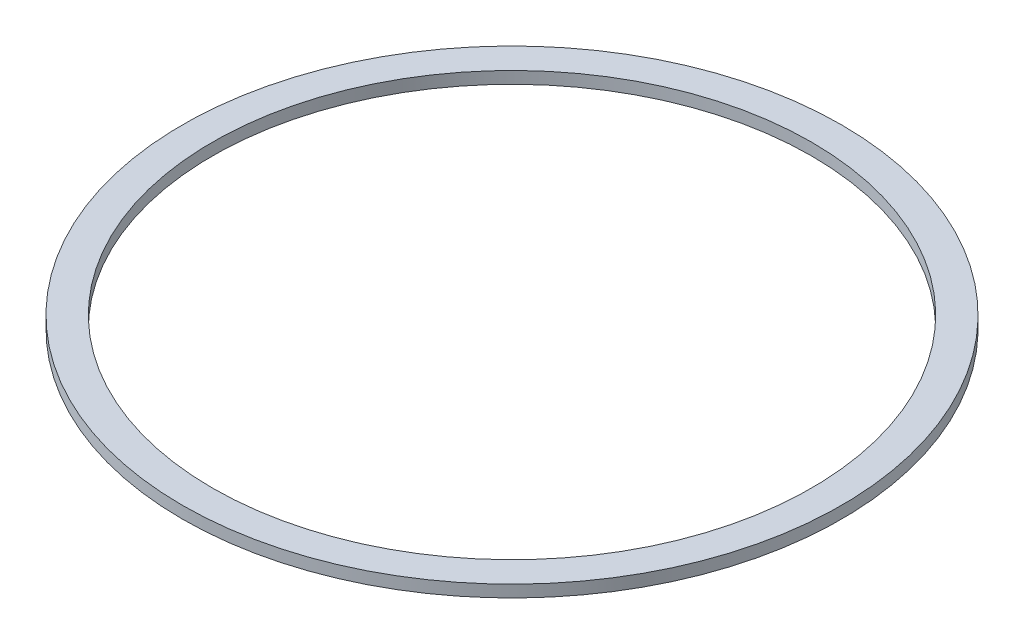
ISO-10303-21;
HEADER;
FILE_DESCRIPTION(('STEP AP214'),'2;1');
FILE_NAME('part.step','',(''),(''),'','','');
FILE_SCHEMA(('AUTOMOTIVE_DESIGN { 1 0 10303 214 1 1 1 1 }'));
ENDSEC;
DATA;
#1=APPLICATION_CONTEXT('core data for automotive mechanical design processes');
#2=APPLICATION_PROTOCOL_DEFINITION('international standard','automotive_design',2000,#1);
#3=PRODUCT_CONTEXT('',#1,'mechanical');
#4=PRODUCT('Part','Part','',(#3));
#5=PRODUCT_RELATED_PRODUCT_CATEGORY('part','',(#4));
#6=PRODUCT_DEFINITION_FORMATION('','',#4);
#7=PRODUCT_DEFINITION_CONTEXT('part definition',#1,'design');
#8=PRODUCT_DEFINITION('design','',#6,#7);
#9=PRODUCT_DEFINITION_SHAPE('','',#8);
#10=(LENGTH_UNIT() NAMED_UNIT(*) SI_UNIT(.MILLI.,.METRE.));
#11=(NAMED_UNIT(*) PLANE_ANGLE_UNIT() SI_UNIT($,.RADIAN.));
#12=(NAMED_UNIT(*) SI_UNIT($,.STERADIAN.) SOLID_ANGLE_UNIT());
#13=UNCERTAINTY_MEASURE_WITH_UNIT(LENGTH_MEASURE(1.E-05),#10,'distance_accuracy_value','');
#14=(GEOMETRIC_REPRESENTATION_CONTEXT(3) GLOBAL_UNCERTAINTY_ASSIGNED_CONTEXT((#13)) GLOBAL_UNIT_ASSIGNED_CONTEXT((#10,
#11,#12)) REPRESENTATION_CONTEXT('',''));
#15=CARTESIAN_POINT('',(0.,0.,0.));
#16=DIRECTION('',(0.,0.,1.));
#17=DIRECTION('',(1.,0.,0.));
#18=AXIS2_PLACEMENT_3D('',#15,#16,#17);
#19=CARTESIAN_POINT('',(0.,3.,0.));
#20=DIRECTION('',(0.,1.,0.));
#21=DIRECTION('',(0.,0.,1.));
#22=AXIS2_PLACEMENT_3D('',#19,#20,#21);
#23=PLANE('',#22);
#24=CARTESIAN_POINT('',(0.,3.,0.));
#25=DIRECTION('',(0.,1.,0.));
#26=DIRECTION('',(0.,0.,1.));
#27=AXIS2_PLACEMENT_3D('',#24,#25,#26);
#28=CIRCLE('',#27,82.5);
#29=CARTESIAN_POINT('',(0.,3.,82.5));
#30=VERTEX_POINT('',#29);
#31=EDGE_CURVE('E10',#30,#30,#28,.T.);
#32=ORIENTED_EDGE('',*,*,#31,.T.);
#33=EDGE_LOOP('',(#32));
#34=FACE_BOUND('',#33,.T.);
#35=CARTESIAN_POINT('',(0.,3.,0.));
#36=DIRECTION('',(0.,1.,0.));
#37=DIRECTION('',(0.,0.,1.));
#38=AXIS2_PLACEMENT_3D('',#35,#36,#37);
#39=CIRCLE('',#38,75.);
#40=CARTESIAN_POINT('',(0.,3.,75.));
#41=VERTEX_POINT('',#40);
#42=EDGE_CURVE('E42',#41,#41,#39,.T.);
#43=ORIENTED_EDGE('',*,*,#42,.F.);
#44=EDGE_LOOP('',(#43));
#45=FACE_BOUND('',#44,.T.);
#46=ADVANCED_FACE('F31',(#34,#45),#23,.T.);
#47=CARTESIAN_POINT('',(0.,0.,0.));
#48=DIRECTION('',(0.,1.,0.));
#49=DIRECTION('',(0.,0.,1.));
#50=AXIS2_PLACEMENT_3D('',#47,#48,#49);
#51=PLANE('',#50);
#52=CARTESIAN_POINT('',(0.,0.,0.));
#53=DIRECTION('',(0.,1.,0.));
#54=DIRECTION('',(0.,0.,1.));
#55=AXIS2_PLACEMENT_3D('',#52,#53,#54);
#56=CIRCLE('',#55,82.5);
#57=CARTESIAN_POINT('',(0.,0.,82.5));
#58=VERTEX_POINT('',#57);
#59=EDGE_CURVE('E35',#58,#58,#56,.T.);
#60=ORIENTED_EDGE('',*,*,#59,.F.);
#61=EDGE_LOOP('',(#60));
#62=FACE_BOUND('',#61,.T.);
#63=CARTESIAN_POINT('',(0.,0.,0.));
#64=DIRECTION('',(0.,1.,0.));
#65=DIRECTION('',(0.,0.,1.));
#66=AXIS2_PLACEMENT_3D('',#63,#64,#65);
#67=CIRCLE('',#66,75.);
#68=CARTESIAN_POINT('',(0.,0.,75.));
#69=VERTEX_POINT('',#68);
#70=EDGE_CURVE('E44',#69,#69,#67,.T.);
#71=ORIENTED_EDGE('',*,*,#70,.T.);
#72=EDGE_LOOP('',(#71));
#73=FACE_BOUND('',#72,.T.);
#74=ADVANCED_FACE('F54',(#62,#73),#51,.F.);
#75=CARTESIAN_POINT('',(0.,3.,0.));
#76=DIRECTION('',(0.,-1.,0.));
#77=DIRECTION('',(0.,0.,-1.));
#78=AXIS2_PLACEMENT_3D('',#75,#76,#77);
#79=CYLINDRICAL_SURFACE('',#78,82.5);
#80=ORIENTED_EDGE('',*,*,#31,.F.);
#81=EDGE_LOOP('',(#80));
#82=FACE_BOUND('',#81,.T.);
#83=ORIENTED_EDGE('',*,*,#59,.T.);
#84=EDGE_LOOP('',(#83));
#85=FACE_BOUND('',#84,.T.);
#86=ADVANCED_FACE('F33',(#82,#85),#79,.T.);
#87=CARTESIAN_POINT('',(0.,3.,0.));
#88=DIRECTION('',(0.,-1.,0.));
#89=DIRECTION('',(0.,0.,-1.));
#90=AXIS2_PLACEMENT_3D('',#87,#88,#89);
#91=CYLINDRICAL_SURFACE('',#90,75.);
#92=ORIENTED_EDGE('',*,*,#42,.T.);
#93=EDGE_LOOP('',(#92));
#94=FACE_BOUND('',#93,.T.);
#95=ORIENTED_EDGE('',*,*,#70,.F.);
#96=EDGE_LOOP('',(#95));
#97=FACE_BOUND('',#96,.T.);
#98=ADVANCED_FACE('F50',(#94,#97),#91,.F.);
#99=CLOSED_SHELL('',(#46,#74,#86,#98));
#100=MANIFOLD_SOLID_BREP('B2',#99);
#101=ADVANCED_BREP_SHAPE_REPRESENTATION('',(#18,#100),#14);
#102=SHAPE_DEFINITION_REPRESENTATION(#9,#101);
ENDSEC;
END-ISO-10303-21;
